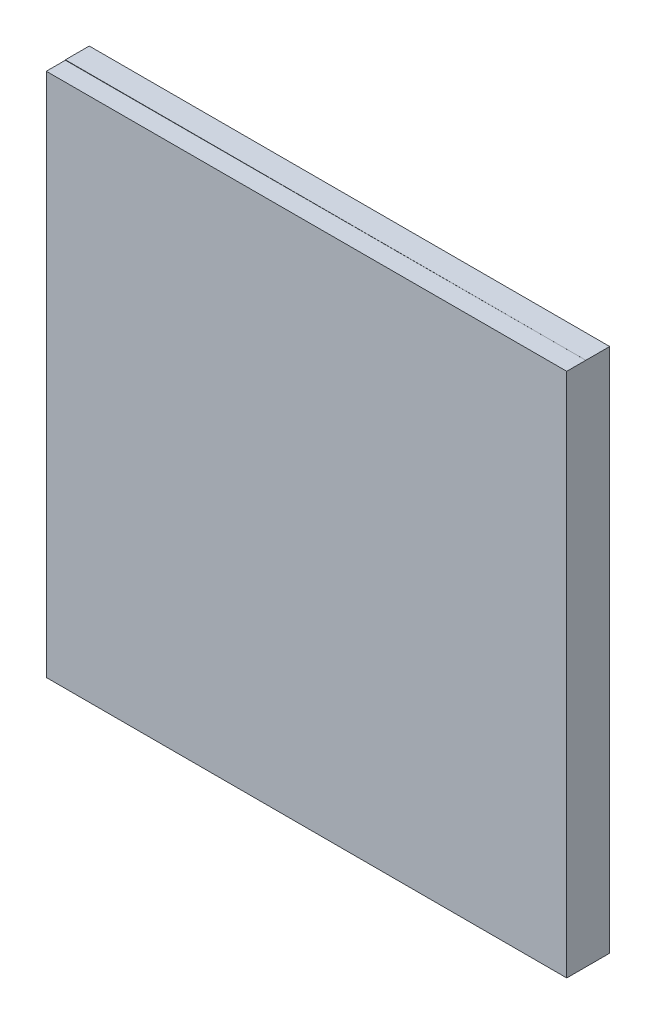
ISO-10303-21;
HEADER;
FILE_DESCRIPTION(('STEP AP214'),'2;1');
FILE_NAME('part.step','',(''),(''),'','','');
FILE_SCHEMA(('AUTOMOTIVE_DESIGN { 1 0 10303 214 1 1 1 1 }'));
ENDSEC;
DATA;
#1=APPLICATION_CONTEXT('core data for automotive mechanical design processes');
#2=APPLICATION_PROTOCOL_DEFINITION('international standard','automotive_design',2000,#1);
#3=PRODUCT_CONTEXT('',#1,'mechanical');
#4=PRODUCT('Part','Part','',(#3));
#5=PRODUCT_RELATED_PRODUCT_CATEGORY('part','',(#4));
#6=PRODUCT_DEFINITION_FORMATION('','',#4);
#7=PRODUCT_DEFINITION_CONTEXT('part definition',#1,'design');
#8=PRODUCT_DEFINITION('design','',#6,#7);
#9=PRODUCT_DEFINITION_SHAPE('','',#8);
#10=(LENGTH_UNIT() NAMED_UNIT(*) SI_UNIT(.MILLI.,.METRE.));
#11=(NAMED_UNIT(*) PLANE_ANGLE_UNIT() SI_UNIT($,.RADIAN.));
#12=(NAMED_UNIT(*) SI_UNIT($,.STERADIAN.) SOLID_ANGLE_UNIT());
#13=UNCERTAINTY_MEASURE_WITH_UNIT(LENGTH_MEASURE(1.E-05),#10,'distance_accuracy_value','');
#14=(GEOMETRIC_REPRESENTATION_CONTEXT(3) GLOBAL_UNCERTAINTY_ASSIGNED_CONTEXT((#13)) GLOBAL_UNIT_ASSIGNED_CONTEXT((#10,
#11,#12)) REPRESENTATION_CONTEXT('',''));
#15=CARTESIAN_POINT('',(0.,0.,0.));
#16=DIRECTION('',(0.,0.,1.));
#17=DIRECTION('',(1.,0.,0.));
#18=AXIS2_PLACEMENT_3D('',#15,#16,#17);
#19=CARTESIAN_POINT('',(0.,0.,0.));
#20=DIRECTION('',(0.,0.,1.));
#21=DIRECTION('',(1.,0.,0.));
#22=AXIS2_PLACEMENT_3D('',#19,#20,#21);
#23=PLANE('',#22);
#24=DIRECTION('',(-0.999999734461256,-0.000728750586202771,0.));
#25=VECTOR('',#24,1.);
#26=CARTESIAN_POINT('',(27.0182391756525,27.5397302093079,0.));
#27=LINE('',#26,#25);
#28=CARTESIAN_POINT('',(27.0182391756525,27.5397302093079,0.));
#29=VERTEX_POINT('',#28);
#30=CARTESIAN_POINT('',(-27.5,27.5,0.));
#31=VERTEX_POINT('',#30);
#32=EDGE_CURVE('E65',#29,#31,#27,.T.);
#33=ORIENTED_EDGE('',*,*,#32,.F.);
#34=DIRECTION('',(1.,0.,0.));
#35=VECTOR('',#34,1.);
#36=CARTESIAN_POINT('',(0.,27.5397302093079,0.));
#37=LINE('',#36,#35);
#38=CARTESIAN_POINT('',(-27.5,27.5397302093079,0.));
#39=VERTEX_POINT('',#38);
#40=EDGE_CURVE('E261',#39,#29,#37,.T.);
#41=ORIENTED_EDGE('',*,*,#40,.F.);
#42=DIRECTION('',(0.,-1.,0.));
#43=VECTOR('',#42,1.);
#44=CARTESIAN_POINT('',(-27.5,0.,0.));
#45=LINE('',#44,#43);
#46=EDGE_CURVE('E265',#39,#31,#45,.T.);
#47=ORIENTED_EDGE('',*,*,#46,.T.);
#48=EDGE_LOOP('',(#33,#41,#47));
#49=FACE_BOUND('',#48,.T.);
#50=ADVANCED_FACE('F37',(#49),#23,.T.);
#51=CARTESIAN_POINT('',(-50.3593446058077,-55.4974981917018,-2.50000000000001));
#52=DIRECTION('',(0.,0.,1.));
#53=DIRECTION('',(1.,0.,0.));
#54=AXIS2_PLACEMENT_3D('',#51,#52,#53);
#55=PLANE('',#54);
#56=CARTESIAN_POINT('',(0.,0.,-2.50000000000001));
#57=DIRECTION('',(0.,0.,1.));
#58=DIRECTION('',(1.,0.,0.));
#59=AXIS2_PLACEMENT_3D('',#56,#57,#58);
#60=CIRCLE('',#59,19.8182477824091);
#61=CARTESIAN_POINT('',(-2.85199727322229,19.6119620823235,-2.50000000000001));
#62=VERTEX_POINT('',#61);
#63=EDGE_CURVE('E244',#62,#62,#60,.F.);
#64=ORIENTED_EDGE('',*,*,#63,.F.);
#65=EDGE_LOOP('',(#64));
#66=FACE_BOUND('',#65,.T.);
#67=DIRECTION('',(0.,1.,0.));
#68=VECTOR('',#67,1.);
#69=CARTESIAN_POINT('',(27.0182391756525,0.,-2.50000000000001));
#70=LINE('',#69,#68);
#71=CARTESIAN_POINT('',(27.0182391756525,-27.5,-2.50000000000001));
#72=VERTEX_POINT('',#71);
#73=CARTESIAN_POINT('',(27.0182391756525,27.5397302093079,-2.50000000000001));
#74=VERTEX_POINT('',#73);
#75=EDGE_CURVE('E248',#72,#74,#70,.T.);
#76=ORIENTED_EDGE('',*,*,#75,.F.);
#77=DIRECTION('',(1.,0.,0.));
#78=VECTOR('',#77,1.);
#79=CARTESIAN_POINT('',(-29.0785643724157,-27.5,-2.50000000000001));
#80=LINE('',#79,#78);
#81=CARTESIAN_POINT('',(-27.5,-27.5,-2.50000000000001));
#82=VERTEX_POINT('',#81);
#83=EDGE_CURVE('E131',#82,#72,#80,.T.);
#84=ORIENTED_EDGE('',*,*,#83,.F.);
#85=DIRECTION('',(0.,1.,0.));
#86=VECTOR('',#85,1.);
#87=CARTESIAN_POINT('',(-27.5,0.,-2.50000000000001));
#88=LINE('',#87,#86);
#89=CARTESIAN_POINT('',(-27.5,27.5397302093079,-2.50000000000001));
#90=VERTEX_POINT('',#89);
#91=EDGE_CURVE('E57',#82,#90,#88,.T.);
#92=ORIENTED_EDGE('',*,*,#91,.T.);
#93=DIRECTION('',(-1.,0.,0.));
#94=VECTOR('',#93,1.);
#95=CARTESIAN_POINT('',(-38.5038670332152,27.5397302093079,-2.50000000000001));
#96=LINE('',#95,#94);
#97=EDGE_CURVE('E263',#74,#90,#96,.T.);
#98=ORIENTED_EDGE('',*,*,#97,.F.);
#99=EDGE_LOOP('',(#76,#84,#92,#98));
#100=FACE_BOUND('',#99,.T.);
#101=ADVANCED_FACE('F159',(#66,#100),#55,.F.);
#102=CARTESIAN_POINT('',(-15.6204028271186,31.1154419838651,-20.1212827093551));
#103=CARTESIAN_POINT('',(-5.38810206058329,21.8968229701192,-6.));
#104=CARTESIAN_POINT('',(-1.04049385367871,17.9799185910409,0.));
#105=CARTESIAN_POINT('',(-77.8512867948487,-0.125363670372147,-20.1212827093551));
#106=CARTESIAN_POINT('',(-49.1817480008216,11.1206188489526,-6.));
#107=CARTESIAN_POINT('',(-37.0003310357604,15.8989308836835,0.));
#108=CARTESIAN_POINT('',(-46.6104811406115,-62.3562476381023,-20.1212827093551));
#109=CARTESIAN_POINT('',(-38.405543879655,-32.6730270912858,-6.));
#110=CARTESIAN_POINT('',(-34.919343328403,-20.0609062983983,0.));
#111=CARTESIAN_POINT('',(15.6204028271186,-31.1154419838651,-20.1212827093551));
#112=CARTESIAN_POINT('',(5.3881020605833,-21.8968229701192,-6.));
#113=CARTESIAN_POINT('',(1.04049385367871,-17.9799185910409,0.));
#114=CARTESIAN_POINT('',(77.8512867948487,0.125363670372136,-20.1212827093551));
#115=CARTESIAN_POINT('',(49.1817480008216,-11.1206188489526,-6.));
#116=CARTESIAN_POINT('',(37.0003310357604,-15.8989308836834,0.));
#117=CARTESIAN_POINT('',(46.6104811406115,62.3562476381022,-20.1212827093551));
#118=CARTESIAN_POINT('',(38.405543879655,32.6730270912857,-6.));
#119=CARTESIAN_POINT('',(34.919343328403,20.0609062983983,0.));
#120=CARTESIAN_POINT('',(-15.6204028271186,31.1154419838651,-20.1212827093551));
#121=CARTESIAN_POINT('',(-5.38810206058329,21.8968229701192,-6.));
#122=CARTESIAN_POINT('',(-1.04049385367871,17.9799185910409,0.));
#123=(BOUNDED_SURFACE() B_SPLINE_SURFACE(3,1,((#102,#103,#104),(#105,#106,#107),(#108,#109,
#110),(#111,#112,#113),(#114,#115,#116),(#117,#118,#119),(#120,#121,#122)),.UNSPECIFIED.,.T.,
.F.,.F.) B_SPLINE_SURFACE_WITH_KNOTS((4,3,4),(2,1,2),(0.,0.5,1.),(-2.35354711822584,0.,1.),
.UNSPECIFIED.) GEOMETRIC_REPRESENTATION_ITEM() RATIONAL_B_SPLINE_SURFACE(((1.,1.,1.),
(0.333333333333333,0.333333333333333,0.333333333333333),(0.333333333333333,0.333333333333333,
0.333333333333333),(1.,1.,1.),(0.333333333333333,0.333333333333333,0.333333333333333),
(0.333333333333333,0.333333333333333,0.333333333333333),(1.,1.,1.))) REPRESENTATION_ITEM('') SURFACE());
#124=CARTESIAN_POINT('',(0.,0.,0.));
#125=DIRECTION('',(0.,0.,1.));
#126=DIRECTION('',(1.,0.,0.));
#127=AXIS2_PLACEMENT_3D('',#124,#125,#126);
#128=CIRCLE('',#127,18.01);
#129=CARTESIAN_POINT('',(-1.04049385367871,17.9799185910409,0.));
#130=VERTEX_POINT('',#129);
#131=EDGE_CURVE('E44',#130,#130,#128,.T.);
#132=CARTESIAN_POINT('',(-2.85199727322229,19.6119620823235,-2.50000000000001));
#133=CARTESIAN_POINT('',(-2.83312744593538,19.5949616292893,-2.47395833333335));
#134=CARTESIAN_POINT('',(-2.81425761864847,19.5779611762551,-2.44791666666668));
#135=CARTESIAN_POINT('',(-2.77651796407464,19.5439602701867,-2.39583333333335));
#136=CARTESIAN_POINT('',(-2.75764813678773,19.5269598171525,-2.36979166666668));
#137=CARTESIAN_POINT('',(-2.71990848221391,19.4929589110841,-2.31770833333335));
#138=CARTESIAN_POINT('',(-2.70103865492699,19.4759584580499,-2.29166666666668));
#139=CARTESIAN_POINT('',(-2.66329900035317,19.4419575519816,-2.23958333333334));
#140=CARTESIAN_POINT('',(-2.64442917306626,19.4249570989474,-2.21354166666668));
#141=CARTESIAN_POINT('',(-2.60668951849243,19.390956192879,-2.16145833333334));
#142=CARTESIAN_POINT('',(-2.58781969120552,19.3739557398448,-2.13541666666668));
#143=CARTESIAN_POINT('',(-2.5500800366317,19.3399548337764,-2.08333333333334));
#144=CARTESIAN_POINT('',(-2.53121020934478,19.3229543807422,-2.05729166666668));
#145=CARTESIAN_POINT('',(-2.49347055477096,19.2889534746738,-2.00520833333334));
#146=CARTESIAN_POINT('',(-2.47460072748405,19.2719530216396,-1.97916666666668));
#147=CARTESIAN_POINT('',(-2.43686107291022,19.2379521155712,-1.92708333333334));
#148=CARTESIAN_POINT('',(-2.41799124562331,19.220951662537,-1.90104166666668));
#149=CARTESIAN_POINT('',(-2.38025159104948,19.1869507564686,-1.84895833333334));
#150=CARTESIAN_POINT('',(-2.36138176376257,19.1699503034344,-1.82291666666668));
#151=CARTESIAN_POINT('',(-2.32364210918875,19.1359493973661,-1.77083333333334));
#152=CARTESIAN_POINT('',(-2.30477228190184,19.1189489443319,-1.74479166666668));
#153=CARTESIAN_POINT('',(-2.26703262732801,19.0849480382635,-1.69270833333334));
#154=CARTESIAN_POINT('',(-2.2481628000411,19.0679475852293,-1.66666666666667));
#155=CARTESIAN_POINT('',(-2.21042314546727,19.0339466791609,-1.61458333333334));
#156=CARTESIAN_POINT('',(-2.19155331818036,19.0169462261267,-1.58854166666667));
#157=CARTESIAN_POINT('',(-2.15381366360654,18.9829453200583,-1.53645833333334));
#158=CARTESIAN_POINT('',(-2.13494383631962,18.9659448670241,-1.51041666666667));
#159=CARTESIAN_POINT('',(-2.0972041817458,18.9319439609557,-1.45833333333334));
#160=CARTESIAN_POINT('',(-2.07833435445889,18.9149435079215,-1.43229166666667));
#161=CARTESIAN_POINT('',(-2.04059469988506,18.8809426018532,-1.38020833333334));
#162=CARTESIAN_POINT('',(-2.02172487259815,18.863942148819,-1.35416666666667));
#163=CARTESIAN_POINT('',(-1.98398521802433,18.8299412427506,-1.30208333333334));
#164=CARTESIAN_POINT('',(-1.96511539073741,18.8129407897164,-1.27604166666667));
#165=CARTESIAN_POINT('',(-1.92737573616359,18.778939883648,-1.22395833333334));
#166=CARTESIAN_POINT('',(-1.90850590887668,18.7619394306138,-1.19791666666667));
#167=CARTESIAN_POINT('',(-1.87076625430285,18.7279385245454,-1.14583333333334));
#168=CARTESIAN_POINT('',(-1.85189642701594,18.7109380715112,-1.11979166666667));
#169=CARTESIAN_POINT('',(-1.81415677244211,18.6769371654428,-1.06770833333334));
#170=CARTESIAN_POINT('',(-1.7952869451552,18.6599367124086,-1.04166666666667));
#171=CARTESIAN_POINT('',(-1.75754729058138,18.6259358063402,-0.989583333333338));
#172=CARTESIAN_POINT('',(-1.73867746329446,18.608935353306,-0.963541666666672));
#173=CARTESIAN_POINT('',(-1.70093780872064,18.5749344472377,-0.911458333333338));
#174=CARTESIAN_POINT('',(-1.68206798143373,18.5579339942035,-0.885416666666671));
#175=CARTESIAN_POINT('',(-1.6443283268599,18.5239330881351,-0.833333333333337));
#176=CARTESIAN_POINT('',(-1.62545849957299,18.5069326351009,-0.80729166666667));
#177=CARTESIAN_POINT('',(-1.58771884499917,18.4729317290325,-0.755208333333337));
#178=CARTESIAN_POINT('',(-1.56884901771225,18.4559312759983,-0.72916666666667));
#179=CARTESIAN_POINT('',(-1.53110936313843,18.4219303699299,-0.677083333333337));
#180=CARTESIAN_POINT('',(-1.51223953585152,18.4049299168957,-0.65104166666667));
#181=CARTESIAN_POINT('',(-1.47449988127769,18.3709290108273,-0.598958333333336));
#182=CARTESIAN_POINT('',(-1.45563005399078,18.3539285577931,-0.57291666666667));
#183=CARTESIAN_POINT('',(-1.41789039941695,18.3199276517247,-0.520833333333336));
#184=CARTESIAN_POINT('',(-1.39902057213004,18.3029271986906,-0.49479166666667));
#185=CARTESIAN_POINT('',(-1.36128091755622,18.2689262926222,-0.442708333333336));
#186=CARTESIAN_POINT('',(-1.3424110902693,18.251925839588,-0.416666666666669));
#187=CARTESIAN_POINT('',(-1.30467143569548,18.2179249335196,-0.364583333333335));
#188=CARTESIAN_POINT('',(-1.28580160840857,18.2009244804854,-0.338541666666668));
#189=CARTESIAN_POINT('',(-1.24806195383474,18.166923574417,-0.286458333333335));
#190=CARTESIAN_POINT('',(-1.22919212654783,18.1499231213828,-0.260416666666668));
#191=CARTESIAN_POINT('',(-1.19145247197401,18.1159222153144,-0.208333333333334));
#192=CARTESIAN_POINT('',(-1.17258264468709,18.0989217622802,-0.182291666666668));
#193=CARTESIAN_POINT('',(-1.13484299011327,18.0649208562118,-0.130208333333334));
#194=CARTESIAN_POINT('',(-1.11597316282636,18.0479204031776,-0.104166666666667));
#195=CARTESIAN_POINT('',(-1.07823350825253,18.0139194971093,-0.0520833333333331));
#196=CARTESIAN_POINT('',(-1.05936368096562,17.9969190440751,-0.0260416666666662));
#197=CARTESIAN_POINT('',(-1.04049385367871,17.9799185910409,0.));
#198=B_SPLINE_CURVE_WITH_KNOTS('',3,(#132,#133,#134,#135,#136,#137,#138,#139,#140,#141,#142,
#143,#144,#145,#146,#147,#148,#149,#150,#151,#152,#153,#154,#155,#156,#157,#158,#159,#160,#161,
#162,#163,#164,#165,#166,#167,#168,#169,#170,#171,#172,#173,#174,#175,#176,#177,#178,#179,#180,
#181,#182,#183,#184,#185,#186,#187,#188,#189,#190,#191,#192,#193,#194,#195,#196,#197),
.UNSPECIFIED.,.F.,.F.,(4,2,2,2,2,2,2,2,2,2,2,2,2,2,2,2,2,2,2,2,2,2,2,2,2,2,2,2,2,2,2,2,4),(0.,
0.109129682909149,0.2182593658183,0.32738904872745,0.4365187316366,0.545648414545751,
0.654778097454902,0.763907780364053,0.873037463273203,0.982167146182354,1.0912968290915,
1.20042651200065,1.3095561949098,1.41868587781896,1.52781556072811,1.63694524363726,
1.74607492654641,1.85520460945556,1.96433429236471,2.07346397527386,2.18259365818301,
2.29172334109216,2.40085302400131,2.50998270691046,2.61911238981961,2.72824207272876,
2.83737175563791,2.94650143854706,3.05563112145621,3.16476080436536,3.27389048727451,
3.38302017018366,3.49214985309281),.UNSPECIFIED.);
#199=EDGE_CURVE('BSEAM39',#62,#130,#198,.T.);
#200=ORIENTED_EDGE('',*,*,#63,.T.);
#201=ORIENTED_EDGE('',*,*,#131,.T.);
#202=ORIENTED_EDGE('',*,*,#199,.T.);
#203=ORIENTED_EDGE('',*,*,#199,.F.);
#204=EDGE_LOOP('',(#200,#202,#201,#203));
#205=FACE_BOUND('',#204,.T.);
#206=ADVANCED_FACE('F39',(#205),#123,.F.);
#207=CARTESIAN_POINT('',(27.0182391756525,0.,9.99999999998398E-05));
#208=DIRECTION('',(-1.,0.,0.));
#209=DIRECTION('',(0.,0.,1.));
#210=AXIS2_PLACEMENT_3D('',#207,#208,#209);
#211=PLANE('',#210);
#212=DIRECTION('',(0.,0.,1.));
#213=VECTOR('',#212,1.);
#214=CARTESIAN_POINT('',(27.0182391756525,27.5397302093079,9.99999999998398E-05));
#215=LINE('',#214,#213);
#216=EDGE_CURVE('E266',#74,#29,#215,.T.);
#217=ORIENTED_EDGE('',*,*,#216,.T.);
#218=DIRECTION('',(0.,0.,-1.));
#219=VECTOR('',#218,1.);
#220=CARTESIAN_POINT('',(27.0182391756525,27.5397302093079,2.));
#221=LINE('',#220,#219);
#222=CARTESIAN_POINT('',(27.0182391756525,27.5397302093079,2.));
#223=VERTEX_POINT('',#222);
#224=EDGE_CURVE('E120',#223,#29,#221,.T.);
#225=ORIENTED_EDGE('',*,*,#224,.F.);
#226=DIRECTION('',(0.,1.,0.));
#227=VECTOR('',#226,1.);
#228=CARTESIAN_POINT('',(27.0182391756525,-27.5,2.));
#229=LINE('',#228,#227);
#230=CARTESIAN_POINT('',(27.0182391756525,-27.5,2.));
#231=VERTEX_POINT('',#230);
#232=EDGE_CURVE('E107',#231,#223,#229,.T.);
#233=ORIENTED_EDGE('',*,*,#232,.F.);
#234=DIRECTION('',(0.,0.,-1.));
#235=VECTOR('',#234,1.);
#236=CARTESIAN_POINT('',(27.0182391756525,-27.5,9.99999999998398E-05));
#237=LINE('',#236,#235);
#238=EDGE_CURVE('E104',#231,#72,#237,.T.);
#239=ORIENTED_EDGE('',*,*,#238,.T.);
#240=ORIENTED_EDGE('',*,*,#75,.T.);
#241=EDGE_LOOP('',(#217,#225,#233,#239,#240));
#242=FACE_BOUND('',#241,.T.);
#243=ADVANCED_FACE('F155',(#242),#211,.F.);
#244=CARTESIAN_POINT('',(-27.5,0.,9.99999999998398E-05));
#245=DIRECTION('',(-1.,0.,0.));
#246=DIRECTION('',(0.,0.,1.));
#247=AXIS2_PLACEMENT_3D('',#244,#245,#246);
#248=PLANE('',#247);
#249=DIRECTION('',(0.,0.,-1.));
#250=VECTOR('',#249,1.);
#251=CARTESIAN_POINT('',(-27.5,-27.5,9.99999999998398E-05));
#252=LINE('',#251,#250);
#253=CARTESIAN_POINT('',(-27.5,-27.5,2.));
#254=VERTEX_POINT('',#253);
#255=EDGE_CURVE('E12',#254,#82,#252,.T.);
#256=ORIENTED_EDGE('',*,*,#255,.F.);
#257=DIRECTION('',(0.,-1.,0.));
#258=VECTOR('',#257,1.);
#259=CARTESIAN_POINT('',(-27.5,-27.5,2.));
#260=LINE('',#259,#258);
#261=CARTESIAN_POINT('',(-27.5,27.5,2.));
#262=VERTEX_POINT('',#261);
#263=EDGE_CURVE('E97',#262,#254,#260,.T.);
#264=ORIENTED_EDGE('',*,*,#263,.F.);
#265=DIRECTION('',(0.,0.,-1.));
#266=VECTOR('',#265,1.);
#267=CARTESIAN_POINT('',(-27.5,27.5,2.));
#268=LINE('',#267,#266);
#269=EDGE_CURVE('E117',#262,#31,#268,.T.);
#270=ORIENTED_EDGE('',*,*,#269,.T.);
#271=ORIENTED_EDGE('',*,*,#46,.F.);
#272=DIRECTION('',(0.,0.,1.));
#273=VECTOR('',#272,1.);
#274=CARTESIAN_POINT('',(-27.5,27.5397302093079,9.99999999998398E-05));
#275=LINE('',#274,#273);
#276=EDGE_CURVE('E50',#90,#39,#275,.T.);
#277=ORIENTED_EDGE('',*,*,#276,.F.);
#278=ORIENTED_EDGE('',*,*,#91,.F.);
#279=EDGE_LOOP('',(#256,#264,#270,#271,#277,#278));
#280=FACE_BOUND('',#279,.T.);
#281=ADVANCED_FACE('F94',(#280),#248,.T.);
#282=CARTESIAN_POINT('',(-38.5038670332152,27.5397302093079,9.99999999998398E-05));
#283=DIRECTION('',(0.,-1.,0.));
#284=DIRECTION('',(0.,0.,-1.));
#285=AXIS2_PLACEMENT_3D('',#282,#283,#284);
#286=PLANE('',#285);
#287=ORIENTED_EDGE('',*,*,#97,.T.);
#288=ORIENTED_EDGE('',*,*,#276,.T.);
#289=ORIENTED_EDGE('',*,*,#40,.T.);
#290=ORIENTED_EDGE('',*,*,#216,.F.);
#291=EDGE_LOOP('',(#287,#288,#289,#290));
#292=FACE_BOUND('',#291,.T.);
#293=ADVANCED_FACE('F149',(#292),#286,.F.);
#294=CARTESIAN_POINT('',(-29.0785643724157,-27.5,9.99999999998398E-05));
#295=DIRECTION('',(0.,1.,0.));
#296=DIRECTION('',(0.,0.,1.));
#297=AXIS2_PLACEMENT_3D('',#294,#295,#296);
#298=PLANE('',#297);
#299=ORIENTED_EDGE('',*,*,#238,.F.);
#300=DIRECTION('',(1.,0.,0.));
#301=VECTOR('',#300,1.);
#302=CARTESIAN_POINT('',(-27.5,-27.5,2.));
#303=LINE('',#302,#301);
#304=EDGE_CURVE('E101',#254,#231,#303,.T.);
#305=ORIENTED_EDGE('',*,*,#304,.F.);
#306=ORIENTED_EDGE('',*,*,#255,.T.);
#307=ORIENTED_EDGE('',*,*,#83,.T.);
#308=EDGE_LOOP('',(#299,#305,#306,#307));
#309=FACE_BOUND('',#308,.T.);
#310=ADVANCED_FACE('F102',(#309),#298,.F.);
#311=CARTESIAN_POINT('',(0.,0.,2.));
#312=DIRECTION('',(0.,0.,-1.));
#313=DIRECTION('',(-1.,0.,0.));
#314=AXIS2_PLACEMENT_3D('',#311,#312,#313);
#315=PLANE('',#314);
#316=ORIENTED_EDGE('',*,*,#263,.T.);
#317=ORIENTED_EDGE('',*,*,#304,.T.);
#318=ORIENTED_EDGE('',*,*,#232,.T.);
#319=DIRECTION('',(-0.999999734461256,-0.000728750586202771,0.));
#320=VECTOR('',#319,1.);
#321=CARTESIAN_POINT('',(27.0182391756525,27.5397302093079,2.));
#322=LINE('',#321,#320);
#323=EDGE_CURVE('E111',#223,#262,#322,.T.);
#324=ORIENTED_EDGE('',*,*,#323,.T.);
#325=EDGE_LOOP('',(#316,#317,#318,#324));
#326=FACE_BOUND('',#325,.T.);
#327=ADVANCED_FACE('F109',(#326),#315,.F.);
#328=CARTESIAN_POINT('',(27.0182391756525,27.5397302093079,2.));
#329=DIRECTION('',(0.000728750586202771,-0.999999734461256,0.));
#330=DIRECTION('',(0.999999734461256,0.000728750586202771,0.));
#331=AXIS2_PLACEMENT_3D('',#328,#329,#330);
#332=PLANE('',#331);
#333=ORIENTED_EDGE('',*,*,#32,.T.);
#334=ORIENTED_EDGE('',*,*,#269,.F.);
#335=ORIENTED_EDGE('',*,*,#323,.F.);
#336=ORIENTED_EDGE('',*,*,#224,.T.);
#337=EDGE_LOOP('',(#333,#334,#335,#336));
#338=FACE_BOUND('',#337,.T.);
#339=ADVANCED_FACE('F143',(#338),#332,.F.);
#340=CARTESIAN_POINT('',(0.,0.,0.));
#341=DIRECTION('',(0.,0.,-1.));
#342=DIRECTION('',(-1.,0.,0.));
#343=AXIS2_PLACEMENT_3D('',#340,#341,#342);
#344=PLANE('',#343);
#345=ORIENTED_EDGE('',*,*,#131,.F.);
#346=EDGE_LOOP('',(#345));
#347=FACE_BOUND('',#346,.T.);
#348=ADVANCED_FACE('F133',(#347),#344,.T.);
#349=CLOSED_SHELL('',(#50,#101,#206,#243,#281,#293,#310,#327,#339,#348));
#350=MANIFOLD_SOLID_BREP('B2',#349);
#351=ADVANCED_BREP_SHAPE_REPRESENTATION('',(#18,#350),#14);
#352=SHAPE_DEFINITION_REPRESENTATION(#9,#351);
ENDSEC;
END-ISO-10303-21;
